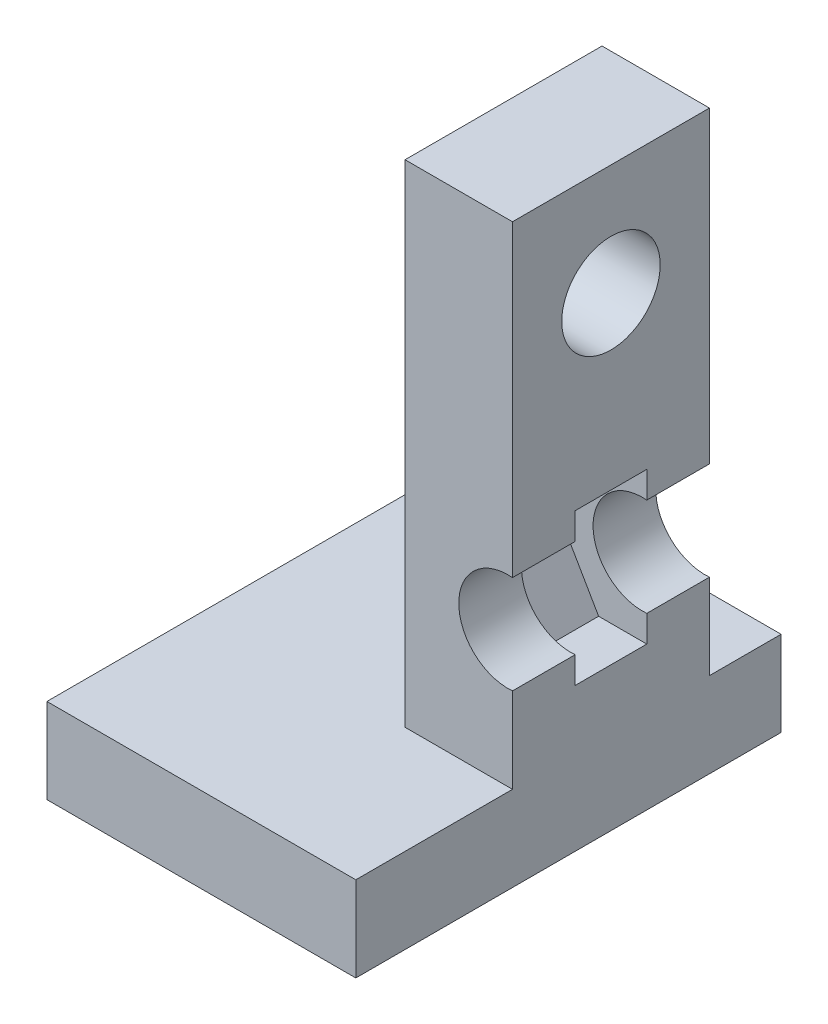
ISO-10303-21;
HEADER;
FILE_DESCRIPTION(('STEP AP214'),'2;1');
FILE_NAME('part.step','',(''),(''),'','','');
FILE_SCHEMA(('AUTOMOTIVE_DESIGN { 1 0 10303 214 1 1 1 1 }'));
ENDSEC;
DATA;
#1=APPLICATION_CONTEXT('core data for automotive mechanical design processes');
#2=APPLICATION_PROTOCOL_DEFINITION('international standard','automotive_design',2000,#1);
#3=PRODUCT_CONTEXT('',#1,'mechanical');
#4=PRODUCT('Part','Part','',(#3));
#5=PRODUCT_RELATED_PRODUCT_CATEGORY('part','',(#4));
#6=PRODUCT_DEFINITION_FORMATION('','',#4);
#7=PRODUCT_DEFINITION_CONTEXT('part definition',#1,'design');
#8=PRODUCT_DEFINITION('design','',#6,#7);
#9=PRODUCT_DEFINITION_SHAPE('','',#8);
#10=(LENGTH_UNIT() NAMED_UNIT(*) SI_UNIT(.MILLI.,.METRE.));
#11=(NAMED_UNIT(*) PLANE_ANGLE_UNIT() SI_UNIT($,.RADIAN.));
#12=(NAMED_UNIT(*) SI_UNIT($,.STERADIAN.) SOLID_ANGLE_UNIT());
#13=UNCERTAINTY_MEASURE_WITH_UNIT(LENGTH_MEASURE(1.E-05),#10,'distance_accuracy_value','');
#14=(GEOMETRIC_REPRESENTATION_CONTEXT(3) GLOBAL_UNCERTAINTY_ASSIGNED_CONTEXT((#13)) GLOBAL_UNIT_ASSIGNED_CONTEXT((#10,
#11,#12)) REPRESENTATION_CONTEXT('',''));
#15=CARTESIAN_POINT('',(0.,0.,0.));
#16=DIRECTION('',(0.,0.,1.));
#17=DIRECTION('',(1.,0.,0.));
#18=AXIS2_PLACEMENT_3D('',#15,#16,#17);
#19=CARTESIAN_POINT('',(-11.8674698795181,-59.7793146590531,8.));
#20=DIRECTION('',(0.,1.,0.));
#21=DIRECTION('',(0.,0.,1.));
#22=AXIS2_PLACEMENT_3D('',#19,#20,#21);
#23=PLANE('',#22);
#24=CARTESIAN_POINT('',(-19.8674698795181,-59.7793146590531,-3.5));
#25=DIRECTION('',(0.,-1.,0.));
#26=DIRECTION('',(0.,0.,-1.));
#27=AXIS2_PLACEMENT_3D('',#24,#25,#26);
#28=CIRCLE('',#27,5.5);
#29=CARTESIAN_POINT('',(-19.8674698795181,-59.7793146590531,-9.00000000000001));
#30=VERTEX_POINT('',#29);
#31=EDGE_CURVE('E553',#30,#30,#28,.T.);
#32=ORIENTED_EDGE('',*,*,#31,.F.);
#33=EDGE_LOOP('',(#32));
#34=FACE_BOUND('',#33,.T.);
#35=DIRECTION('',(0.,0.,-1.));
#36=VECTOR('',#35,1.);
#37=CARTESIAN_POINT('',(0.132530120481924,-59.7793146590531,15.));
#38=LINE('',#37,#36);
#39=CARTESIAN_POINT('',(0.132530120481922,-59.7793146590531,32.5));
#40=VERTEX_POINT('',#39);
#41=CARTESIAN_POINT('',(0.132530120481925,-59.7793146590531,-15.));
#42=VERTEX_POINT('',#41);
#43=EDGE_CURVE('E212',#40,#42,#38,.T.);
#44=ORIENTED_EDGE('',*,*,#43,.F.);
#45=DIRECTION('',(-1.,0.,0.));
#46=VECTOR('',#45,1.);
#47=CARTESIAN_POINT('',(-34.3674698795181,-59.7793146590531,32.5));
#48=LINE('',#47,#46);
#49=CARTESIAN_POINT('',(-34.3674698795181,-59.7793146590531,32.5));
#50=VERTEX_POINT('',#49);
#51=EDGE_CURVE('E175',#40,#50,#48,.T.);
#52=ORIENTED_EDGE('',*,*,#51,.T.);
#53=DIRECTION('',(0.,0.,-1.));
#54=VECTOR('',#53,1.);
#55=CARTESIAN_POINT('',(-34.3674698795181,-59.7793146590531,-15.));
#56=LINE('',#55,#54);
#57=CARTESIAN_POINT('',(-34.3674698795181,-59.7793146590531,-15.));
#58=VERTEX_POINT('',#57);
#59=EDGE_CURVE('E191',#50,#58,#56,.T.);
#60=ORIENTED_EDGE('',*,*,#59,.T.);
#61=DIRECTION('',(1.,0.,0.));
#62=VECTOR('',#61,1.);
#63=CARTESIAN_POINT('',(0.132530120481925,-59.7793146590531,-15.));
#64=LINE('',#63,#62);
#65=EDGE_CURVE('E168',#58,#42,#64,.T.);
#66=ORIENTED_EDGE('',*,*,#65,.T.);
#67=EDGE_LOOP('',(#44,#52,#60,#66));
#68=FACE_BOUND('',#67,.T.);
#69=ADVANCED_FACE('F37',(#34,#68),#23,.F.);
#70=CARTESIAN_POINT('',(-11.8674698795181,4.62068534094692,8.));
#71=DIRECTION('',(0.,-1.,0.));
#72=DIRECTION('',(1.,0.,0.));
#73=AXIS2_PLACEMENT_3D('',#70,#71,#72);
#74=PLANE('',#73);
#75=DIRECTION('',(0.,0.,1.));
#76=VECTOR('',#75,1.);
#77=CARTESIAN_POINT('',(0.132530120481913,4.62068534094692,15.));
#78=LINE('',#77,#76);
#79=CARTESIAN_POINT('',(0.132530120481913,4.62068534094692,-7.));
#80=VERTEX_POINT('',#79);
#81=CARTESIAN_POINT('',(0.132530120481913,4.62068534094692,15.));
#82=VERTEX_POINT('',#81);
#83=EDGE_CURVE('E216',#80,#82,#78,.T.);
#84=ORIENTED_EDGE('',*,*,#83,.F.);
#85=DIRECTION('',(1.,0.,0.));
#86=VECTOR('',#85,1.);
#87=CARTESIAN_POINT('',(11.1325301204819,4.62068534094692,-7.));
#88=LINE('',#87,#86);
#89=CARTESIAN_POINT('',(-11.8674698795181,4.62068534094692,-7.));
#90=VERTEX_POINT('',#89);
#91=EDGE_CURVE('E250',#90,#80,#88,.T.);
#92=ORIENTED_EDGE('',*,*,#91,.F.);
#93=DIRECTION('',(0.,0.,-1.));
#94=VECTOR('',#93,1.);
#95=CARTESIAN_POINT('',(-11.8674698795181,4.62068534094692,8.));
#96=LINE('',#95,#94);
#97=CARTESIAN_POINT('',(-11.8674698795181,4.62068534094692,15.));
#98=VERTEX_POINT('',#97);
#99=EDGE_CURVE('E11',#98,#90,#96,.T.);
#100=ORIENTED_EDGE('',*,*,#99,.F.);
#101=DIRECTION('',(-1.,0.,0.));
#102=VECTOR('',#101,1.);
#103=CARTESIAN_POINT('',(-11.8674698795181,4.62068534094692,15.));
#104=LINE('',#103,#102);
#105=EDGE_CURVE('E262',#82,#98,#104,.T.);
#106=ORIENTED_EDGE('',*,*,#105,.F.);
#107=EDGE_LOOP('',(#84,#92,#100,#106));
#108=FACE_BOUND('',#107,.T.);
#109=ADVANCED_FACE('F319',(#108),#74,.F.);
#110=CARTESIAN_POINT('',(4.51113989513426,-26.8293146590531,8.));
#111=DIRECTION('',(0.,-1.,0.));
#112=DIRECTION('',(0.,0.,-1.));
#113=AXIS2_PLACEMENT_3D('',#110,#111,#112);
#114=PLANE('',#113);
#115=DIRECTION('',(-1.,0.,0.));
#116=VECTOR('',#115,1.);
#117=CARTESIAN_POINT('',(4.51113989513426,-26.8293146590531,0.));
#118=LINE('',#117,#116);
#119=CARTESIAN_POINT('',(0.132530120481917,-26.8293146590531,0.));
#120=VERTEX_POINT('',#119);
#121=CARTESIAN_POINT('',(-5.24607965417042,-26.8293146590531,0.));
#122=VERTEX_POINT('',#121);
#123=EDGE_CURVE('E264',#120,#122,#118,.T.);
#124=ORIENTED_EDGE('',*,*,#123,.F.);
#125=DIRECTION('',(0.,0.,1.));
#126=VECTOR('',#125,1.);
#127=CARTESIAN_POINT('',(0.132530120481917,-26.8293146590531,8.));
#128=LINE('',#127,#126);
#129=CARTESIAN_POINT('',(0.132530120481917,-26.8293146590531,8.));
#130=VERTEX_POINT('',#129);
#131=EDGE_CURVE('E233',#120,#130,#128,.T.);
#132=ORIENTED_EDGE('',*,*,#131,.T.);
#133=DIRECTION('',(-1.,0.,0.));
#134=VECTOR('',#133,1.);
#135=CARTESIAN_POINT('',(4.51113989513426,-26.8293146590531,8.));
#136=LINE('',#135,#134);
#137=CARTESIAN_POINT('',(-5.24607965417042,-26.8293146590531,8.));
#138=VERTEX_POINT('',#137);
#139=EDGE_CURVE('E265',#130,#138,#136,.T.);
#140=ORIENTED_EDGE('',*,*,#139,.T.);
#141=DIRECTION('',(0.,0.,-1.));
#142=VECTOR('',#141,1.);
#143=CARTESIAN_POINT('',(-5.24607965417042,-26.8293146590531,8.));
#144=LINE('',#143,#142);
#145=EDGE_CURVE('E46',#138,#122,#144,.T.);
#146=ORIENTED_EDGE('',*,*,#145,.T.);
#147=EDGE_LOOP('',(#124,#132,#140,#146));
#148=FACE_BOUND('',#147,.T.);
#149=ADVANCED_FACE('F295',(#148),#114,.T.);
#150=CARTESIAN_POINT('',(-5.24607965417041,-43.7293146590531,8.));
#151=DIRECTION('',(0.,1.,0.));
#152=DIRECTION('',(0.,0.,1.));
#153=AXIS2_PLACEMENT_3D('',#150,#151,#152);
#154=PLANE('',#153);
#155=DIRECTION('',(1.,0.,0.));
#156=VECTOR('',#155,1.);
#157=CARTESIAN_POINT('',(-5.24607965417041,-43.7293146590531,8.));
#158=LINE('',#157,#156);
#159=CARTESIAN_POINT('',(-5.24607965417041,-43.7293146590531,8.));
#160=VERTEX_POINT('',#159);
#161=CARTESIAN_POINT('',(0.13253012048192,-43.7293146590531,8.));
#162=VERTEX_POINT('',#161);
#163=EDGE_CURVE('E274',#160,#162,#158,.T.);
#164=ORIENTED_EDGE('',*,*,#163,.T.);
#165=DIRECTION('',(0.,0.,-1.));
#166=VECTOR('',#165,1.);
#167=CARTESIAN_POINT('',(0.13253012048192,-43.7293146590531,8.));
#168=LINE('',#167,#166);
#169=CARTESIAN_POINT('',(0.13253012048192,-43.7293146590531,0.));
#170=VERTEX_POINT('',#169);
#171=EDGE_CURVE('E222',#162,#170,#168,.T.);
#172=ORIENTED_EDGE('',*,*,#171,.T.);
#173=DIRECTION('',(1.,0.,0.));
#174=VECTOR('',#173,1.);
#175=CARTESIAN_POINT('',(-5.24607965417041,-43.7293146590531,0.));
#176=LINE('',#175,#174);
#177=CARTESIAN_POINT('',(-5.24607965417041,-43.7293146590531,0.));
#178=VERTEX_POINT('',#177);
#179=EDGE_CURVE('E268',#178,#170,#176,.T.);
#180=ORIENTED_EDGE('',*,*,#179,.F.);
#181=DIRECTION('',(0.,0.,-1.));
#182=VECTOR('',#181,1.);
#183=CARTESIAN_POINT('',(-5.24607965417041,-43.7293146590531,8.));
#184=LINE('',#183,#182);
#185=EDGE_CURVE('E277',#160,#178,#184,.T.);
#186=ORIENTED_EDGE('',*,*,#185,.F.);
#187=EDGE_LOOP('',(#164,#172,#180,#186));
#188=FACE_BOUND('',#187,.T.);
#189=ADVANCED_FACE('F338',(#188),#154,.T.);
#190=CARTESIAN_POINT('',(0.,0.,15.));
#191=DIRECTION('',(0.,0.,1.));
#192=DIRECTION('',(1.,0.,0.));
#193=AXIS2_PLACEMENT_3D('',#190,#191,#192);
#194=PLANE('',#193);
#195=DIRECTION('',(-1.,0.,0.));
#196=VECTOR('',#195,1.);
#197=CARTESIAN_POINT('',(0.,-50.2793146590531,15.));
#198=LINE('',#197,#196);
#199=CARTESIAN_POINT('',(0.132530120481923,-50.2793146590531,15.));
#200=VERTEX_POINT('',#199);
#201=CARTESIAN_POINT('',(-11.8674698795181,-50.2793146590531,15.));
#202=VERTEX_POINT('',#201);
#203=EDGE_CURVE('E208',#200,#202,#198,.T.);
#204=ORIENTED_EDGE('',*,*,#203,.F.);
#205=DIRECTION('',(0.,-1.,0.));
#206=VECTOR('',#205,1.);
#207=CARTESIAN_POINT('',(0.132530120481913,4.62068534094692,15.));
#208=LINE('',#207,#206);
#209=CARTESIAN_POINT('',(0.13253012048192,-40.7565402341047,15.));
#210=VERTEX_POINT('',#209);
#211=EDGE_CURVE('E163',#210,#200,#208,.T.);
#212=ORIENTED_EDGE('',*,*,#211,.F.);
#213=CARTESIAN_POINT('',(-0.367469879518079,-35.2793146590531,15.));
#214=DIRECTION('',(0.,0.,1.));
#215=DIRECTION('',(1.,0.,0.));
#216=AXIS2_PLACEMENT_3D('',#213,#214,#215);
#217=CIRCLE('',#216,5.5);
#218=CARTESIAN_POINT('',(0.132530120481919,-29.8020890840014,15.));
#219=VERTEX_POINT('',#218);
#220=EDGE_CURVE('E254',#219,#210,#217,.T.);
#221=ORIENTED_EDGE('',*,*,#220,.F.);
#222=EDGE_CURVE('E210',#82,#219,#208,.T.);
#223=ORIENTED_EDGE('',*,*,#222,.F.);
#224=ORIENTED_EDGE('',*,*,#105,.T.);
#225=DIRECTION('',(0.,-1.,0.));
#226=VECTOR('',#225,1.);
#227=CARTESIAN_POINT('',(-11.8674698795181,4.62068534094692,15.));
#228=LINE('',#227,#226);
#229=EDGE_CURVE('E257',#98,#202,#228,.T.);
#230=ORIENTED_EDGE('',*,*,#229,.T.);
#231=EDGE_LOOP('',(#204,#212,#221,#223,#224,#230));
#232=FACE_BOUND('',#231,.T.);
#233=ADVANCED_FACE('F325',(#232),#194,.T.);
#234=CARTESIAN_POINT('',(0.,0.,8.));
#235=DIRECTION('',(0.,0.,1.));
#236=DIRECTION('',(1.,0.,0.));
#237=AXIS2_PLACEMENT_3D('',#234,#235,#236);
#238=PLANE('',#237);
#239=DIRECTION('',(0.,1.,0.));
#240=VECTOR('',#239,1.);
#241=CARTESIAN_POINT('',(0.132530120481913,0.,8.));
#242=LINE('',#241,#240);
#243=CARTESIAN_POINT('',(0.13253012048192,-40.7565402341047,8.));
#244=VERTEX_POINT('',#243);
#245=EDGE_CURVE('E225',#162,#244,#242,.T.);
#246=ORIENTED_EDGE('',*,*,#245,.F.);
#247=ORIENTED_EDGE('',*,*,#163,.F.);
#248=DIRECTION('',(0.5,-0.866025403784438,0.));
#249=VECTOR('',#248,1.);
#250=CARTESIAN_POINT('',(-10.1246894288228,-35.2793146590531,8.));
#251=LINE('',#250,#249);
#252=CARTESIAN_POINT('',(-10.1246894288228,-35.2793146590531,8.));
#253=VERTEX_POINT('',#252);
#254=EDGE_CURVE('E271',#253,#160,#251,.T.);
#255=ORIENTED_EDGE('',*,*,#254,.F.);
#256=DIRECTION('',(-0.5,-0.866025403784439,0.));
#257=VECTOR('',#256,1.);
#258=CARTESIAN_POINT('',(-5.24607965417042,-26.8293146590531,8.));
#259=LINE('',#258,#257);
#260=EDGE_CURVE('E267',#138,#253,#259,.T.);
#261=ORIENTED_EDGE('',*,*,#260,.F.);
#262=ORIENTED_EDGE('',*,*,#139,.F.);
#263=CARTESIAN_POINT('',(0.132530120481918,-29.8020890840014,8.));
#264=VERTEX_POINT('',#263);
#265=EDGE_CURVE('E228',#264,#130,#242,.T.);
#266=ORIENTED_EDGE('',*,*,#265,.F.);
#267=CARTESIAN_POINT('',(-0.367469879518079,-35.2793146590531,8.));
#268=DIRECTION('',(0.,0.,1.));
#269=DIRECTION('',(1.,0.,0.));
#270=AXIS2_PLACEMENT_3D('',#267,#268,#269);
#271=CIRCLE('',#270,5.5);
#272=EDGE_CURVE('E253',#264,#244,#271,.T.);
#273=ORIENTED_EDGE('',*,*,#272,.T.);
#274=EDGE_LOOP('',(#246,#247,#255,#261,#262,#266,#273));
#275=FACE_BOUND('',#274,.T.);
#276=ADVANCED_FACE('F332',(#275),#238,.F.);
#277=CARTESIAN_POINT('',(-0.367469879518079,-35.2793146590531,15.));
#278=DIRECTION('',(0.,0.,-1.));
#279=DIRECTION('',(-1.,0.,0.));
#280=AXIS2_PLACEMENT_3D('',#277,#278,#279);
#281=CYLINDRICAL_SURFACE('',#280,5.5);
#282=ORIENTED_EDGE('',*,*,#220,.T.);
#283=DIRECTION('',(0.,0.,-1.));
#284=VECTOR('',#283,1.);
#285=CARTESIAN_POINT('',(0.13253012048192,-40.7565402341047,15.));
#286=LINE('',#285,#284);
#287=EDGE_CURVE('E227',#210,#244,#286,.T.);
#288=ORIENTED_EDGE('',*,*,#287,.T.);
#289=ORIENTED_EDGE('',*,*,#272,.F.);
#290=DIRECTION('',(0.,0.,-1.));
#291=VECTOR('',#290,1.);
#292=CARTESIAN_POINT('',(0.132530120481918,-29.8020890840014,15.));
#293=LINE('',#292,#291);
#294=EDGE_CURVE('E236',#264,#219,#293,.F.);
#295=ORIENTED_EDGE('',*,*,#294,.T.);
#296=EDGE_LOOP('',(#282,#288,#289,#295));
#297=FACE_BOUND('',#296,.T.);
#298=ADVANCED_FACE('F327',(#297),#281,.F.);
#299=CARTESIAN_POINT('',(0.,0.,0.));
#300=DIRECTION('',(0.,0.,-1.));
#301=DIRECTION('',(-1.,0.,0.));
#302=AXIS2_PLACEMENT_3D('',#299,#300,#301);
#303=PLANE('',#302);
#304=DIRECTION('',(0.,-1.,0.));
#305=VECTOR('',#304,1.);
#306=CARTESIAN_POINT('',(0.132530120481913,0.,0.));
#307=LINE('',#306,#305);
#308=CARTESIAN_POINT('',(0.132530120481918,-29.8020890840014,0.));
#309=VERTEX_POINT('',#308);
#310=EDGE_CURVE('E53',#120,#309,#307,.T.);
#311=ORIENTED_EDGE('',*,*,#310,.F.);
#312=ORIENTED_EDGE('',*,*,#123,.T.);
#313=DIRECTION('',(-0.5,-0.866025403784439,0.));
#314=VECTOR('',#313,1.);
#315=CARTESIAN_POINT('',(-5.24607965417042,-26.8293146590531,0.));
#316=LINE('',#315,#314);
#317=CARTESIAN_POINT('',(-10.1246894288228,-35.2793146590531,0.));
#318=VERTEX_POINT('',#317);
#319=EDGE_CURVE('E279',#122,#318,#316,.T.);
#320=ORIENTED_EDGE('',*,*,#319,.T.);
#321=DIRECTION('',(0.5,-0.866025403784438,0.));
#322=VECTOR('',#321,1.);
#323=CARTESIAN_POINT('',(-10.1246894288228,-35.2793146590531,0.));
#324=LINE('',#323,#322);
#325=EDGE_CURVE('E282',#318,#178,#324,.T.);
#326=ORIENTED_EDGE('',*,*,#325,.T.);
#327=ORIENTED_EDGE('',*,*,#179,.T.);
#328=CARTESIAN_POINT('',(0.13253012048192,-40.7565402341047,0.));
#329=VERTEX_POINT('',#328);
#330=EDGE_CURVE('E220',#329,#170,#307,.T.);
#331=ORIENTED_EDGE('',*,*,#330,.F.);
#332=CARTESIAN_POINT('',(-0.367469879518079,-35.2793146590531,0.));
#333=DIRECTION('',(0.,0.,-1.));
#334=DIRECTION('',(-1.,0.,0.));
#335=AXIS2_PLACEMENT_3D('',#332,#333,#334);
#336=CIRCLE('',#335,5.5);
#337=EDGE_CURVE('E242',#329,#309,#336,.T.);
#338=ORIENTED_EDGE('',*,*,#337,.T.);
#339=EDGE_LOOP('',(#311,#312,#320,#326,#327,#331,#338));
#340=FACE_BOUND('',#339,.T.);
#341=ADVANCED_FACE('F303',(#340),#303,.F.);
#342=CARTESIAN_POINT('',(0.,0.,-7.));
#343=DIRECTION('',(0.,0.,-1.));
#344=DIRECTION('',(-1.,0.,0.));
#345=AXIS2_PLACEMENT_3D('',#342,#343,#344);
#346=PLANE('',#345);
#347=DIRECTION('',(1.,0.,0.));
#348=VECTOR('',#347,1.);
#349=CARTESIAN_POINT('',(0.,-50.2793146590531,-7.));
#350=LINE('',#349,#348);
#351=CARTESIAN_POINT('',(-11.8674698795181,-50.2793146590531,-7.));
#352=VERTEX_POINT('',#351);
#353=CARTESIAN_POINT('',(0.132530120481924,-50.2793146590531,-7.));
#354=VERTEX_POINT('',#353);
#355=EDGE_CURVE('E206',#352,#354,#350,.T.);
#356=ORIENTED_EDGE('',*,*,#355,.F.);
#357=DIRECTION('',(0.,1.,0.));
#358=VECTOR('',#357,1.);
#359=CARTESIAN_POINT('',(-11.8674698795181,4.62068534094692,-7.));
#360=LINE('',#359,#358);
#361=EDGE_CURVE('E246',#352,#90,#360,.T.);
#362=ORIENTED_EDGE('',*,*,#361,.T.);
#363=ORIENTED_EDGE('',*,*,#91,.T.);
#364=DIRECTION('',(0.,1.,0.));
#365=VECTOR('',#364,1.);
#366=CARTESIAN_POINT('',(0.132530120481913,4.62068534094692,-7.));
#367=LINE('',#366,#365);
#368=CARTESIAN_POINT('',(0.132530120481919,-29.8020890840014,-7.));
#369=VERTEX_POINT('',#368);
#370=EDGE_CURVE('E214',#369,#80,#367,.T.);
#371=ORIENTED_EDGE('',*,*,#370,.F.);
#372=CARTESIAN_POINT('',(-0.367469879518079,-35.2793146590531,-7.));
#373=DIRECTION('',(0.,0.,-1.));
#374=DIRECTION('',(-1.,0.,0.));
#375=AXIS2_PLACEMENT_3D('',#372,#373,#374);
#376=CIRCLE('',#375,5.5);
#377=CARTESIAN_POINT('',(0.13253012048192,-40.7565402341047,-7.));
#378=VERTEX_POINT('',#377);
#379=EDGE_CURVE('E243',#378,#369,#376,.T.);
#380=ORIENTED_EDGE('',*,*,#379,.F.);
#381=EDGE_CURVE('E61',#354,#378,#367,.T.);
#382=ORIENTED_EDGE('',*,*,#381,.F.);
#383=EDGE_LOOP('',(#356,#362,#363,#371,#380,#382));
#384=FACE_BOUND('',#383,.T.);
#385=ADVANCED_FACE('F314',(#384),#346,.T.);
#386=CARTESIAN_POINT('',(-0.367469879518079,-35.2793146590531,-7.));
#387=DIRECTION('',(0.,0.,1.));
#388=DIRECTION('',(1.,0.,0.));
#389=AXIS2_PLACEMENT_3D('',#386,#387,#388);
#390=CYLINDRICAL_SURFACE('',#389,5.5);
#391=ORIENTED_EDGE('',*,*,#379,.T.);
#392=DIRECTION('',(0.,0.,1.));
#393=VECTOR('',#392,1.);
#394=CARTESIAN_POINT('',(0.132530120481918,-29.8020890840014,-7.));
#395=LINE('',#394,#393);
#396=EDGE_CURVE('E231',#369,#309,#395,.T.);
#397=ORIENTED_EDGE('',*,*,#396,.T.);
#398=ORIENTED_EDGE('',*,*,#337,.F.);
#399=DIRECTION('',(0.,0.,1.));
#400=VECTOR('',#399,1.);
#401=CARTESIAN_POINT('',(0.13253012048192,-40.7565402341047,-7.));
#402=LINE('',#401,#400);
#403=EDGE_CURVE('E218',#329,#378,#402,.F.);
#404=ORIENTED_EDGE('',*,*,#403,.T.);
#405=EDGE_LOOP('',(#391,#397,#398,#404));
#406=FACE_BOUND('',#405,.T.);
#407=ADVANCED_FACE('F307',(#406),#390,.F.);
#408=CARTESIAN_POINT('',(-11.8674698795181,-7.77931465905308,4.));
#409=DIRECTION('',(1.,0.,0.));
#410=DIRECTION('',(0.,1.,0.));
#411=AXIS2_PLACEMENT_3D('',#408,#409,#410);
#412=CYLINDRICAL_SURFACE('',#411,5.5);
#413=CARTESIAN_POINT('',(-11.8674698795181,-7.77931465905308,4.));
#414=DIRECTION('',(1.,0.,0.));
#415=DIRECTION('',(0.,1.,0.));
#416=AXIS2_PLACEMENT_3D('',#413,#414,#415);
#417=CIRCLE('',#416,5.5);
#418=CARTESIAN_POINT('',(-11.8674698795181,-2.27931465905308,4.));
#419=VERTEX_POINT('',#418);
#420=EDGE_CURVE('E239',#419,#419,#417,.T.);
#421=ORIENTED_EDGE('',*,*,#420,.F.);
#422=EDGE_LOOP('',(#421));
#423=FACE_BOUND('',#422,.T.);
#424=CARTESIAN_POINT('',(0.132530120481915,-7.77931465905308,4.));
#425=DIRECTION('',(1.,0.,0.));
#426=DIRECTION('',(0.,1.,0.));
#427=AXIS2_PLACEMENT_3D('',#424,#425,#426);
#428=CIRCLE('',#427,5.5);
#429=CARTESIAN_POINT('',(0.132530120481914,-2.27931465905308,4.));
#430=VERTEX_POINT('',#429);
#431=EDGE_CURVE('E41',#430,#430,#428,.F.);
#432=ORIENTED_EDGE('',*,*,#431,.F.);
#433=EDGE_LOOP('',(#432));
#434=FACE_BOUND('',#433,.T.);
#435=ADVANCED_FACE('F373',(#423,#434),#412,.F.);
#436=CARTESIAN_POINT('',(-11.8674698795181,4.62068534094692,8.));
#437=DIRECTION('',(1.,0.,0.));
#438=DIRECTION('',(0.,1.,0.));
#439=AXIS2_PLACEMENT_3D('',#436,#437,#438);
#440=PLANE('',#439);
#441=ORIENTED_EDGE('',*,*,#420,.T.);
#442=EDGE_LOOP('',(#441));
#443=FACE_BOUND('',#442,.T.);
#444=ORIENTED_EDGE('',*,*,#361,.F.);
#445=DIRECTION('',(0.,0.,1.));
#446=VECTOR('',#445,1.);
#447=CARTESIAN_POINT('',(-11.8674698795181,-50.2793146590531,8.));
#448=LINE('',#447,#446);
#449=EDGE_CURVE('E200',#352,#202,#448,.T.);
#450=ORIENTED_EDGE('',*,*,#449,.T.);
#451=ORIENTED_EDGE('',*,*,#229,.F.);
#452=ORIENTED_EDGE('',*,*,#99,.T.);
#453=EDGE_LOOP('',(#444,#450,#451,#452));
#454=FACE_BOUND('',#453,.T.);
#455=ADVANCED_FACE('F39',(#443,#454),#440,.F.);
#456=CARTESIAN_POINT('',(-5.24607965417042,-26.8293146590531,8.));
#457=DIRECTION('',(0.866025403784439,-0.5,0.));
#458=DIRECTION('',(0.5,0.866025403784439,0.));
#459=AXIS2_PLACEMENT_3D('',#456,#457,#458);
#460=PLANE('',#459);
#461=ORIENTED_EDGE('',*,*,#319,.F.);
#462=ORIENTED_EDGE('',*,*,#145,.F.);
#463=ORIENTED_EDGE('',*,*,#260,.T.);
#464=DIRECTION('',(0.,0.,-1.));
#465=VECTOR('',#464,1.);
#466=CARTESIAN_POINT('',(-10.1246894288228,-35.2793146590531,8.));
#467=LINE('',#466,#465);
#468=EDGE_CURVE('E288',#253,#318,#467,.T.);
#469=ORIENTED_EDGE('',*,*,#468,.T.);
#470=EDGE_LOOP('',(#461,#462,#463,#469));
#471=FACE_BOUND('',#470,.T.);
#472=ADVANCED_FACE('F299',(#471),#460,.T.);
#473=CARTESIAN_POINT('',(-10.1246894288228,-35.2793146590531,8.));
#474=DIRECTION('',(0.866025403784439,0.5,0.));
#475=DIRECTION('',(-0.5,0.866025403784439,0.));
#476=AXIS2_PLACEMENT_3D('',#473,#474,#475);
#477=PLANE('',#476);
#478=ORIENTED_EDGE('',*,*,#325,.F.);
#479=ORIENTED_EDGE('',*,*,#468,.F.);
#480=ORIENTED_EDGE('',*,*,#254,.T.);
#481=ORIENTED_EDGE('',*,*,#185,.T.);
#482=EDGE_LOOP('',(#478,#479,#480,#481));
#483=FACE_BOUND('',#482,.T.);
#484=ADVANCED_FACE('F334',(#483),#477,.T.);
#485=CARTESIAN_POINT('',(0.132530120481913,0.,0.));
#486=DIRECTION('',(1.,0.,0.));
#487=DIRECTION('',(0.,1.,0.));
#488=AXIS2_PLACEMENT_3D('',#485,#486,#487);
#489=PLANE('',#488);
#490=ORIENTED_EDGE('',*,*,#431,.T.);
#491=EDGE_LOOP('',(#490));
#492=FACE_BOUND('',#491,.T.);
#493=ORIENTED_EDGE('',*,*,#265,.T.);
#494=ORIENTED_EDGE('',*,*,#131,.F.);
#495=ORIENTED_EDGE('',*,*,#310,.T.);
#496=ORIENTED_EDGE('',*,*,#396,.F.);
#497=ORIENTED_EDGE('',*,*,#370,.T.);
#498=ORIENTED_EDGE('',*,*,#83,.T.);
#499=ORIENTED_EDGE('',*,*,#222,.T.);
#500=ORIENTED_EDGE('',*,*,#294,.F.);
#501=EDGE_LOOP('',(#493,#494,#495,#496,#497,#498,#499,#500));
#502=FACE_BOUND('',#501,.T.);
#503=ADVANCED_FACE('F310',(#492,#502),#489,.T.);
#504=ORIENTED_EDGE('',*,*,#211,.T.);
#505=DIRECTION('',(0.,0.,1.));
#506=VECTOR('',#505,1.);
#507=CARTESIAN_POINT('',(0.132530120481922,-50.2793146590531,32.5));
#508=LINE('',#507,#506);
#509=CARTESIAN_POINT('',(0.132530120481922,-50.2793146590531,32.5));
#510=VERTEX_POINT('',#509);
#511=EDGE_CURVE('E157',#200,#510,#508,.T.);
#512=ORIENTED_EDGE('',*,*,#511,.T.);
#513=DIRECTION('',(0.,-1.,0.));
#514=VECTOR('',#513,1.);
#515=CARTESIAN_POINT('',(0.132530120481922,-50.2793146590531,32.5));
#516=LINE('',#515,#514);
#517=EDGE_CURVE('E160',#510,#40,#516,.T.);
#518=ORIENTED_EDGE('',*,*,#517,.T.);
#519=ORIENTED_EDGE('',*,*,#43,.T.);
#520=DIRECTION('',(0.,-1.,0.));
#521=VECTOR('',#520,1.);
#522=CARTESIAN_POINT('',(0.132530120481925,-50.2793146590531,-15.));
#523=LINE('',#522,#521);
#524=CARTESIAN_POINT('',(0.132530120481925,-50.2793146590531,-15.));
#525=VERTEX_POINT('',#524);
#526=EDGE_CURVE('E197',#525,#42,#523,.T.);
#527=ORIENTED_EDGE('',*,*,#526,.F.);
#528=EDGE_CURVE('E167',#525,#354,#508,.T.);
#529=ORIENTED_EDGE('',*,*,#528,.T.);
#530=ORIENTED_EDGE('',*,*,#381,.T.);
#531=ORIENTED_EDGE('',*,*,#403,.F.);
#532=ORIENTED_EDGE('',*,*,#330,.T.);
#533=ORIENTED_EDGE('',*,*,#171,.F.);
#534=ORIENTED_EDGE('',*,*,#245,.T.);
#535=ORIENTED_EDGE('',*,*,#287,.F.);
#536=EDGE_LOOP('',(#504,#512,#518,#519,#527,#529,#530,#531,#532,#533,#534,#535));
#537=FACE_BOUND('',#536,.T.);
#538=ADVANCED_FACE('F159',(#537),#489,.T.);
#539=CARTESIAN_POINT('',(0.132530120481925,-50.2793146590531,-15.));
#540=DIRECTION('',(0.,0.,-1.));
#541=DIRECTION('',(-1.,0.,0.));
#542=AXIS2_PLACEMENT_3D('',#539,#540,#541);
#543=PLANE('',#542);
#544=ORIENTED_EDGE('',*,*,#65,.F.);
#545=DIRECTION('',(0.,-1.,0.));
#546=VECTOR('',#545,1.);
#547=CARTESIAN_POINT('',(-34.3674698795181,-50.2793146590531,-15.));
#548=LINE('',#547,#546);
#549=CARTESIAN_POINT('',(-34.3674698795181,-50.2793146590531,-15.));
#550=VERTEX_POINT('',#549);
#551=EDGE_CURVE('E201',#550,#58,#548,.T.);
#552=ORIENTED_EDGE('',*,*,#551,.F.);
#553=DIRECTION('',(1.,0.,0.));
#554=VECTOR('',#553,1.);
#555=CARTESIAN_POINT('',(0.132530120481925,-50.2793146590531,-15.));
#556=LINE('',#555,#554);
#557=EDGE_CURVE('E177',#550,#525,#556,.T.);
#558=ORIENTED_EDGE('',*,*,#557,.T.);
#559=ORIENTED_EDGE('',*,*,#526,.T.);
#560=EDGE_LOOP('',(#544,#552,#558,#559));
#561=FACE_BOUND('',#560,.T.);
#562=ADVANCED_FACE('F368',(#561),#543,.T.);
#563=CARTESIAN_POINT('',(-34.3674698795181,-50.2793146590531,-15.));
#564=DIRECTION('',(-1.,0.,0.));
#565=DIRECTION('',(0.,0.,1.));
#566=AXIS2_PLACEMENT_3D('',#563,#564,#565);
#567=PLANE('',#566);
#568=ORIENTED_EDGE('',*,*,#59,.F.);
#569=DIRECTION('',(0.,-1.,0.));
#570=VECTOR('',#569,1.);
#571=CARTESIAN_POINT('',(-34.3674698795181,-50.2793146590531,32.5));
#572=LINE('',#571,#570);
#573=CARTESIAN_POINT('',(-34.3674698795181,-50.2793146590531,32.5));
#574=VERTEX_POINT('',#573);
#575=EDGE_CURVE('E176',#574,#50,#572,.T.);
#576=ORIENTED_EDGE('',*,*,#575,.F.);
#577=DIRECTION('',(0.,0.,-1.));
#578=VECTOR('',#577,1.);
#579=CARTESIAN_POINT('',(-34.3674698795181,-50.2793146590531,-15.));
#580=LINE('',#579,#578);
#581=EDGE_CURVE('E183',#574,#550,#580,.T.);
#582=ORIENTED_EDGE('',*,*,#581,.T.);
#583=ORIENTED_EDGE('',*,*,#551,.T.);
#584=EDGE_LOOP('',(#568,#576,#582,#583));
#585=FACE_BOUND('',#584,.T.);
#586=ADVANCED_FACE('F519',(#585),#567,.T.);
#587=CARTESIAN_POINT('',(-34.3674698795181,-50.2793146590531,32.5));
#588=DIRECTION('',(0.,0.,1.));
#589=DIRECTION('',(1.,0.,0.));
#590=AXIS2_PLACEMENT_3D('',#587,#588,#589);
#591=PLANE('',#590);
#592=ORIENTED_EDGE('',*,*,#51,.F.);
#593=ORIENTED_EDGE('',*,*,#517,.F.);
#594=DIRECTION('',(-1.,0.,0.));
#595=VECTOR('',#594,1.);
#596=CARTESIAN_POINT('',(-34.3674698795181,-50.2793146590531,32.5));
#597=LINE('',#596,#595);
#598=EDGE_CURVE('E173',#510,#574,#597,.T.);
#599=ORIENTED_EDGE('',*,*,#598,.T.);
#600=ORIENTED_EDGE('',*,*,#575,.T.);
#601=EDGE_LOOP('',(#592,#593,#599,#600));
#602=FACE_BOUND('',#601,.T.);
#603=ADVANCED_FACE('F172',(#602),#591,.T.);
#604=CARTESIAN_POINT('',(0.,-50.2793146590531,0.));
#605=DIRECTION('',(0.,1.,0.));
#606=DIRECTION('',(0.,0.,1.));
#607=AXIS2_PLACEMENT_3D('',#604,#605,#606);
#608=PLANE('',#607);
#609=ORIENTED_EDGE('',*,*,#511,.F.);
#610=ORIENTED_EDGE('',*,*,#203,.T.);
#611=ORIENTED_EDGE('',*,*,#449,.F.);
#612=ORIENTED_EDGE('',*,*,#355,.T.);
#613=ORIENTED_EDGE('',*,*,#528,.F.);
#614=ORIENTED_EDGE('',*,*,#557,.F.);
#615=ORIENTED_EDGE('',*,*,#581,.F.);
#616=ORIENTED_EDGE('',*,*,#598,.F.);
#617=EDGE_LOOP('',(#609,#610,#611,#612,#613,#614,#615,#616));
#618=FACE_BOUND('',#617,.T.);
#619=ADVANCED_FACE('F180',(#618),#608,.T.);
#620=CARTESIAN_POINT('',(-19.8674698795181,-57.2793146590531,-3.5));
#621=DIRECTION('',(0.,-1.,0.));
#622=DIRECTION('',(0.,0.,-1.));
#623=AXIS2_PLACEMENT_3D('',#620,#621,#622);
#624=CYLINDRICAL_SURFACE('',#623,5.5);
#625=CARTESIAN_POINT('',(-19.8674698795181,-57.2793146590531,-3.5));
#626=DIRECTION('',(0.,-1.,0.));
#627=DIRECTION('',(0.,0.,-1.));
#628=AXIS2_PLACEMENT_3D('',#625,#626,#627);
#629=CIRCLE('',#628,5.5);
#630=CARTESIAN_POINT('',(-19.8674698795181,-57.2793146590531,-9.00000000000001));
#631=VERTEX_POINT('',#630);
#632=EDGE_CURVE('E192',#631,#631,#629,.T.);
#633=ORIENTED_EDGE('',*,*,#632,.F.);
#634=EDGE_LOOP('',(#633));
#635=FACE_BOUND('',#634,.T.);
#636=ORIENTED_EDGE('',*,*,#31,.T.);
#637=EDGE_LOOP('',(#636));
#638=FACE_BOUND('',#637,.T.);
#639=ADVANCED_FACE('F496',(#635,#638),#624,.F.);
#640=CARTESIAN_POINT('',(-19.8674698795181,-57.2793146590531,-3.5));
#641=DIRECTION('',(0.,-1.,0.));
#642=DIRECTION('',(0.,0.,-1.));
#643=AXIS2_PLACEMENT_3D('',#640,#641,#642);
#644=PLANE('',#643);
#645=ORIENTED_EDGE('',*,*,#632,.T.);
#646=EDGE_LOOP('',(#645));
#647=FACE_BOUND('',#646,.T.);
#648=ADVANCED_FACE('F501',(#647),#644,.T.);
#649=CLOSED_SHELL('',(#69,#109,#149,#189,#233,#276,#298,#341,#385,#407,#435,#455,#472,#484,#503,
#538,#562,#586,#603,#619,#639,#648));
#650=MANIFOLD_SOLID_BREP('B2',#649);
#651=ADVANCED_BREP_SHAPE_REPRESENTATION('',(#18,#650),#14);
#652=SHAPE_DEFINITION_REPRESENTATION(#9,#651);
ENDSEC;
END-ISO-10303-21;
